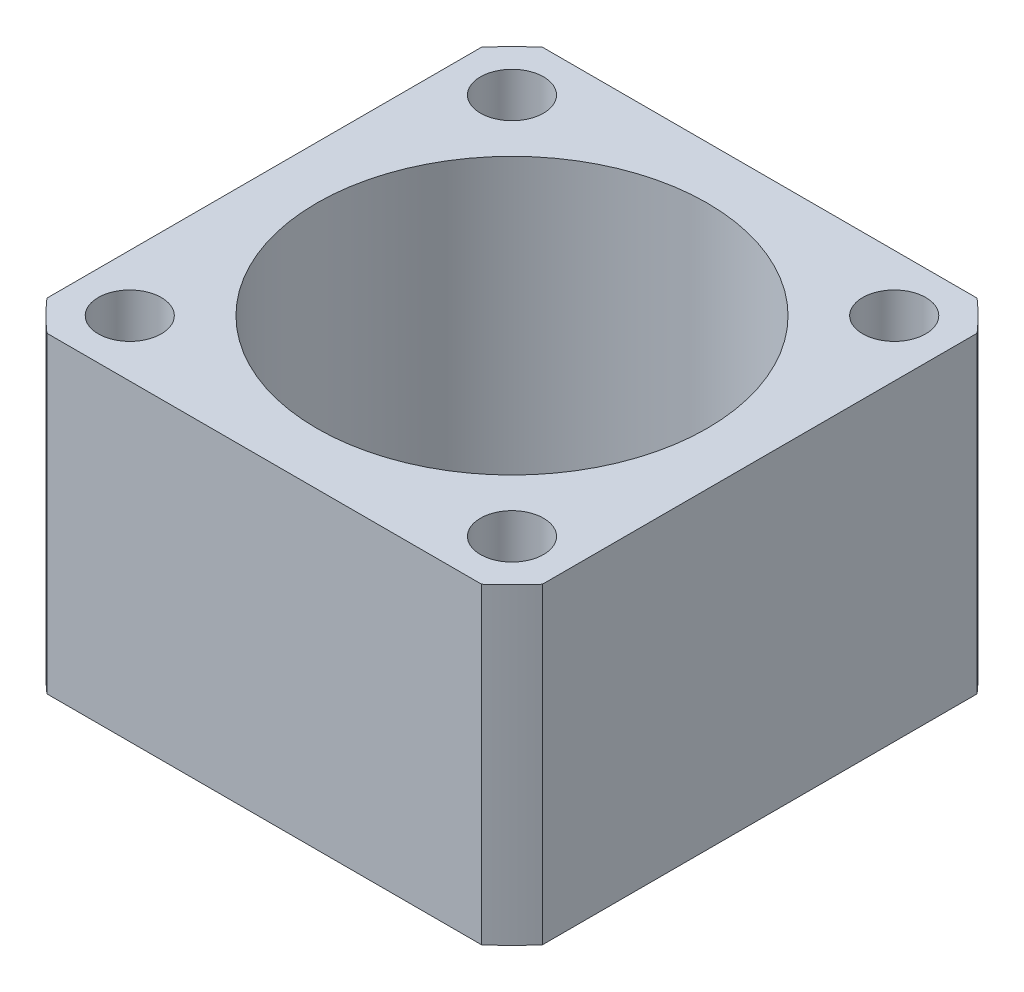
ISO-10303-21;
HEADER;
FILE_DESCRIPTION(('STEP AP214'),'2;1');
FILE_NAME('part.step','',(''),(''),'','','');
FILE_SCHEMA(('AUTOMOTIVE_DESIGN { 1 0 10303 214 1 1 1 1 }'));
ENDSEC;
DATA;
#1=APPLICATION_CONTEXT('core data for automotive mechanical design processes');
#2=APPLICATION_PROTOCOL_DEFINITION('international standard','automotive_design',2000,#1);
#3=PRODUCT_CONTEXT('',#1,'mechanical');
#4=PRODUCT('Part','Part','',(#3));
#5=PRODUCT_RELATED_PRODUCT_CATEGORY('part','',(#4));
#6=PRODUCT_DEFINITION_FORMATION('','',#4);
#7=PRODUCT_DEFINITION_CONTEXT('part definition',#1,'design');
#8=PRODUCT_DEFINITION('design','',#6,#7);
#9=PRODUCT_DEFINITION_SHAPE('','',#8);
#10=(LENGTH_UNIT() NAMED_UNIT(*) SI_UNIT(.MILLI.,.METRE.));
#11=(NAMED_UNIT(*) PLANE_ANGLE_UNIT() SI_UNIT($,.RADIAN.));
#12=(NAMED_UNIT(*) SI_UNIT($,.STERADIAN.) SOLID_ANGLE_UNIT());
#13=UNCERTAINTY_MEASURE_WITH_UNIT(LENGTH_MEASURE(1.E-05),#10,'distance_accuracy_value','');
#14=(GEOMETRIC_REPRESENTATION_CONTEXT(3) GLOBAL_UNCERTAINTY_ASSIGNED_CONTEXT((#13)) GLOBAL_UNIT_ASSIGNED_CONTEXT((#10,
#11,#12)) REPRESENTATION_CONTEXT('',''));
#15=CARTESIAN_POINT('',(0.,0.,0.));
#16=DIRECTION('',(0.,0.,1.));
#17=DIRECTION('',(1.,0.,0.));
#18=AXIS2_PLACEMENT_3D('',#15,#16,#17);
#19=CARTESIAN_POINT('',(0.,10.4,0.));
#20=DIRECTION('',(0.,1.,0.));
#21=DIRECTION('',(1.,0.,0.));
#22=AXIS2_PLACEMENT_3D('',#19,#20,#21);
#23=PLANE('',#22);
#24=CARTESIAN_POINT('',(0.,10.4,0.));
#25=DIRECTION('',(0.,-1.,0.));
#26=DIRECTION('',(1.,0.,0.));
#27=AXIS2_PLACEMENT_3D('',#24,#25,#26);
#28=CIRCLE('',#27,6.5);
#29=CARTESIAN_POINT('',(-6.5,10.4,0.));
#30=VERTEX_POINT('',#29);
#31=EDGE_CURVE('E241',#30,#30,#28,.T.);
#32=ORIENTED_EDGE('',*,*,#31,.T.);
#33=EDGE_LOOP('',(#32));
#34=FACE_BOUND('',#33,.T.);
#35=CARTESIAN_POINT('',(-6.36396103067893,10.4,-6.36396103067893));
#36=DIRECTION('',(0.,-1.,0.));
#37=DIRECTION('',(1.,0.,0.));
#38=AXIS2_PLACEMENT_3D('',#35,#36,#37);
#39=CIRCLE('',#38,1.05);
#40=CARTESIAN_POINT('',(-7.41396103067893,10.4,-6.36396103067893));
#41=VERTEX_POINT('',#40);
#42=EDGE_CURVE('E209',#41,#41,#39,.T.);
#43=ORIENTED_EDGE('',*,*,#42,.T.);
#44=EDGE_LOOP('',(#43));
#45=FACE_BOUND('',#44,.T.);
#46=CARTESIAN_POINT('',(6.36396103067893,10.4,-6.36396103067893));
#47=DIRECTION('',(0.,-1.,0.));
#48=DIRECTION('',(1.,0.,0.));
#49=AXIS2_PLACEMENT_3D('',#46,#47,#48);
#50=CIRCLE('',#49,1.05);
#51=CARTESIAN_POINT('',(5.31396103067893,10.4,-6.36396103067893));
#52=VERTEX_POINT('',#51);
#53=EDGE_CURVE('E234',#52,#52,#50,.T.);
#54=ORIENTED_EDGE('',*,*,#53,.T.);
#55=EDGE_LOOP('',(#54));
#56=FACE_BOUND('',#55,.T.);
#57=CARTESIAN_POINT('',(-6.36396103067893,10.4,6.36396103067893));
#58=DIRECTION('',(0.,-1.,0.));
#59=DIRECTION('',(1.,0.,0.));
#60=AXIS2_PLACEMENT_3D('',#57,#58,#59);
#61=CIRCLE('',#60,1.05);
#62=CARTESIAN_POINT('',(-7.41396103067893,10.4,6.36396103067893));
#63=VERTEX_POINT('',#62);
#64=EDGE_CURVE('E249',#63,#63,#61,.T.);
#65=ORIENTED_EDGE('',*,*,#64,.T.);
#66=EDGE_LOOP('',(#65));
#67=FACE_BOUND('',#66,.T.);
#68=CARTESIAN_POINT('',(6.36396103067893,10.4,6.36396103067893));
#69=DIRECTION('',(0.,-1.,0.));
#70=DIRECTION('',(1.,0.,0.));
#71=AXIS2_PLACEMENT_3D('',#68,#69,#70);
#72=CIRCLE('',#71,1.05);
#73=CARTESIAN_POINT('',(5.31396103067893,10.4,6.36396103067893));
#74=VERTEX_POINT('',#73);
#75=EDGE_CURVE('E27',#74,#74,#72,.T.);
#76=ORIENTED_EDGE('',*,*,#75,.T.);
#77=EDGE_LOOP('',(#76));
#78=FACE_BOUND('',#77,.T.);
#79=DIRECTION('',(0.,0.,-1.));
#80=VECTOR('',#79,1.);
#81=CARTESIAN_POINT('',(8.25,10.4,-3.61898207373289));
#82=LINE('',#81,#80);
#83=CARTESIAN_POINT('',(8.25,10.4,7.23796414746578));
#84=VERTEX_POINT('',#83);
#85=CARTESIAN_POINT('',(8.25,10.4,-7.23796414746578));
#86=VERTEX_POINT('',#85);
#87=EDGE_CURVE('E182',#84,#86,#82,.T.);
#88=ORIENTED_EDGE('',*,*,#87,.T.);
#89=CARTESIAN_POINT('',(0.,10.4,0.));
#90=DIRECTION('',(0.,1.,0.));
#91=DIRECTION('',(1.,0.,0.));
#92=AXIS2_PLACEMENT_3D('',#89,#90,#91);
#93=CIRCLE('',#92,10.975);
#94=CARTESIAN_POINT('',(7.23796414746578,10.4,-8.25));
#95=VERTEX_POINT('',#94);
#96=EDGE_CURVE('E166',#86,#95,#93,.T.);
#97=ORIENTED_EDGE('',*,*,#96,.T.);
#98=DIRECTION('',(-1.,0.,0.));
#99=VECTOR('',#98,1.);
#100=CARTESIAN_POINT('',(-3.61898207373289,10.4,-8.25));
#101=LINE('',#100,#99);
#102=CARTESIAN_POINT('',(-7.23796414746578,10.4,-8.25));
#103=VERTEX_POINT('',#102);
#104=EDGE_CURVE('E171',#95,#103,#101,.T.);
#105=ORIENTED_EDGE('',*,*,#104,.T.);
#106=CARTESIAN_POINT('',(0.,10.4,0.));
#107=DIRECTION('',(0.,1.,0.));
#108=DIRECTION('',(1.,0.,0.));
#109=AXIS2_PLACEMENT_3D('',#106,#107,#108);
#110=CIRCLE('',#109,10.975);
#111=CARTESIAN_POINT('',(-8.25,10.4,-7.23796414746578));
#112=VERTEX_POINT('',#111);
#113=EDGE_CURVE('E219',#103,#112,#110,.T.);
#114=ORIENTED_EDGE('',*,*,#113,.T.);
#115=DIRECTION('',(0.,0.,1.));
#116=VECTOR('',#115,1.);
#117=CARTESIAN_POINT('',(-8.25,10.4,3.61898207373289));
#118=LINE('',#117,#116);
#119=CARTESIAN_POINT('',(-8.25,10.4,7.23796414746578));
#120=VERTEX_POINT('',#119);
#121=EDGE_CURVE('E194',#112,#120,#118,.T.);
#122=ORIENTED_EDGE('',*,*,#121,.T.);
#123=CARTESIAN_POINT('',(0.,10.4,0.));
#124=DIRECTION('',(0.,1.,0.));
#125=DIRECTION('',(1.,0.,0.));
#126=AXIS2_PLACEMENT_3D('',#123,#124,#125);
#127=CIRCLE('',#126,10.975);
#128=CARTESIAN_POINT('',(-7.23796414746578,10.4,8.25));
#129=VERTEX_POINT('',#128);
#130=EDGE_CURVE('E216',#120,#129,#127,.T.);
#131=ORIENTED_EDGE('',*,*,#130,.T.);
#132=DIRECTION('',(1.,0.,0.));
#133=VECTOR('',#132,1.);
#134=CARTESIAN_POINT('',(3.61898207373289,10.4,8.25));
#135=LINE('',#134,#133);
#136=CARTESIAN_POINT('',(7.23796414746578,10.4,8.25));
#137=VERTEX_POINT('',#136);
#138=EDGE_CURVE('E269',#129,#137,#135,.T.);
#139=ORIENTED_EDGE('',*,*,#138,.T.);
#140=CARTESIAN_POINT('',(0.,10.4,0.));
#141=DIRECTION('',(0.,1.,0.));
#142=DIRECTION('',(1.,0.,0.));
#143=AXIS2_PLACEMENT_3D('',#140,#141,#142);
#144=CIRCLE('',#143,10.975);
#145=EDGE_CURVE('E222',#137,#84,#144,.T.);
#146=ORIENTED_EDGE('',*,*,#145,.T.);
#147=EDGE_LOOP('',(#88,#97,#105,#114,#122,#131,#139,#146));
#148=FACE_BOUND('',#147,.T.);
#149=ADVANCED_FACE('F16',(#34,#45,#56,#67,#78,#148),#23,.T.);
#150=CARTESIAN_POINT('',(6.36396103067893,0.,6.36396103067893));
#151=DIRECTION('',(0.,1.,0.));
#152=DIRECTION('',(1.,0.,0.));
#153=AXIS2_PLACEMENT_3D('',#150,#151,#152);
#154=CYLINDRICAL_SURFACE('',#153,1.05);
#155=ORIENTED_EDGE('',*,*,#75,.F.);
#156=DIRECTION('',(0.,-1.,0.));
#157=VECTOR('',#156,1.);
#158=CARTESIAN_POINT('',(5.31396103067893,0.,6.36396103067893));
#159=LINE('',#158,#157);
#160=CARTESIAN_POINT('',(5.31396103067893,0.,6.36396103067893));
#161=VERTEX_POINT('',#160);
#162=EDGE_CURVE('E11',#74,#161,#159,.T.);
#163=ORIENTED_EDGE('',*,*,#162,.T.);
#164=CARTESIAN_POINT('',(6.36396103067893,0.,6.36396103067893));
#165=DIRECTION('',(0.,-1.,0.));
#166=DIRECTION('',(1.,0.,0.));
#167=AXIS2_PLACEMENT_3D('',#164,#165,#166);
#168=CIRCLE('',#167,1.05);
#169=EDGE_CURVE('E186',#161,#161,#168,.T.);
#170=ORIENTED_EDGE('',*,*,#169,.T.);
#171=ORIENTED_EDGE('',*,*,#162,.F.);
#172=EDGE_LOOP('',(#155,#163,#170,#171));
#173=FACE_BOUND('',#172,.T.);
#174=ADVANCED_FACE('F317',(#173),#154,.F.);
#175=CARTESIAN_POINT('',(-6.36396103067893,0.,6.36396103067893));
#176=DIRECTION('',(0.,1.,0.));
#177=DIRECTION('',(1.,0.,0.));
#178=AXIS2_PLACEMENT_3D('',#175,#176,#177);
#179=CYLINDRICAL_SURFACE('',#178,1.05);
#180=ORIENTED_EDGE('',*,*,#64,.F.);
#181=DIRECTION('',(0.,-1.,0.));
#182=VECTOR('',#181,1.);
#183=CARTESIAN_POINT('',(-7.41396103067893,0.,6.36396103067893));
#184=LINE('',#183,#182);
#185=CARTESIAN_POINT('',(-7.41396103067893,0.,6.36396103067893));
#186=VERTEX_POINT('',#185);
#187=EDGE_CURVE('E253',#63,#186,#184,.T.);
#188=ORIENTED_EDGE('',*,*,#187,.T.);
#189=CARTESIAN_POINT('',(-6.36396103067893,0.,6.36396103067893));
#190=DIRECTION('',(0.,-1.,0.));
#191=DIRECTION('',(1.,0.,0.));
#192=AXIS2_PLACEMENT_3D('',#189,#190,#191);
#193=CIRCLE('',#192,1.05);
#194=EDGE_CURVE('E197',#186,#186,#193,.T.);
#195=ORIENTED_EDGE('',*,*,#194,.T.);
#196=ORIENTED_EDGE('',*,*,#187,.F.);
#197=EDGE_LOOP('',(#180,#188,#195,#196));
#198=FACE_BOUND('',#197,.T.);
#199=ADVANCED_FACE('F323',(#198),#179,.F.);
#200=CARTESIAN_POINT('',(6.36396103067893,0.,-6.36396103067893));
#201=DIRECTION('',(0.,1.,0.));
#202=DIRECTION('',(1.,0.,0.));
#203=AXIS2_PLACEMENT_3D('',#200,#201,#202);
#204=CYLINDRICAL_SURFACE('',#203,1.05);
#205=ORIENTED_EDGE('',*,*,#53,.F.);
#206=DIRECTION('',(0.,-1.,0.));
#207=VECTOR('',#206,1.);
#208=CARTESIAN_POINT('',(5.31396103067893,0.,-6.36396103067893));
#209=LINE('',#208,#207);
#210=CARTESIAN_POINT('',(5.31396103067893,0.,-6.36396103067893));
#211=VERTEX_POINT('',#210);
#212=EDGE_CURVE('E238',#52,#211,#209,.T.);
#213=ORIENTED_EDGE('',*,*,#212,.T.);
#214=CARTESIAN_POINT('',(6.36396103067893,0.,-6.36396103067893));
#215=DIRECTION('',(0.,-1.,0.));
#216=DIRECTION('',(1.,0.,0.));
#217=AXIS2_PLACEMENT_3D('',#214,#215,#216);
#218=CIRCLE('',#217,1.05);
#219=EDGE_CURVE('E190',#211,#211,#218,.T.);
#220=ORIENTED_EDGE('',*,*,#219,.T.);
#221=ORIENTED_EDGE('',*,*,#212,.F.);
#222=EDGE_LOOP('',(#205,#213,#220,#221));
#223=FACE_BOUND('',#222,.T.);
#224=ADVANCED_FACE('F329',(#223),#204,.F.);
#225=CARTESIAN_POINT('',(-6.36396103067893,0.,-6.36396103067893));
#226=DIRECTION('',(0.,1.,0.));
#227=DIRECTION('',(1.,0.,0.));
#228=AXIS2_PLACEMENT_3D('',#225,#226,#227);
#229=CYLINDRICAL_SURFACE('',#228,1.05);
#230=ORIENTED_EDGE('',*,*,#42,.F.);
#231=DIRECTION('',(0.,-1.,0.));
#232=VECTOR('',#231,1.);
#233=CARTESIAN_POINT('',(-7.41396103067893,0.,-6.36396103067893));
#234=LINE('',#233,#232);
#235=CARTESIAN_POINT('',(-7.41396103067893,0.,-6.36396103067893));
#236=VERTEX_POINT('',#235);
#237=EDGE_CURVE('E140',#41,#236,#234,.T.);
#238=ORIENTED_EDGE('',*,*,#237,.T.);
#239=CARTESIAN_POINT('',(-6.36396103067893,0.,-6.36396103067893));
#240=DIRECTION('',(0.,-1.,0.));
#241=DIRECTION('',(1.,0.,0.));
#242=AXIS2_PLACEMENT_3D('',#239,#240,#241);
#243=CIRCLE('',#242,1.05);
#244=EDGE_CURVE('E187',#236,#236,#243,.T.);
#245=ORIENTED_EDGE('',*,*,#244,.T.);
#246=ORIENTED_EDGE('',*,*,#237,.F.);
#247=EDGE_LOOP('',(#230,#238,#245,#246));
#248=FACE_BOUND('',#247,.T.);
#249=ADVANCED_FACE('F334',(#248),#229,.F.);
#250=CARTESIAN_POINT('',(0.,0.,0.));
#251=DIRECTION('',(0.,1.,0.));
#252=DIRECTION('',(1.,0.,0.));
#253=AXIS2_PLACEMENT_3D('',#250,#251,#252);
#254=CYLINDRICAL_SURFACE('',#253,6.5);
#255=ORIENTED_EDGE('',*,*,#31,.F.);
#256=DIRECTION('',(0.,-1.,0.));
#257=VECTOR('',#256,1.);
#258=CARTESIAN_POINT('',(-6.5,0.,0.));
#259=LINE('',#258,#257);
#260=CARTESIAN_POINT('',(-6.5,0.,0.));
#261=VERTEX_POINT('',#260);
#262=EDGE_CURVE('E129',#30,#261,#259,.T.);
#263=ORIENTED_EDGE('',*,*,#262,.T.);
#264=CARTESIAN_POINT('',(0.,0.,0.));
#265=DIRECTION('',(0.,-1.,0.));
#266=DIRECTION('',(1.,0.,0.));
#267=AXIS2_PLACEMENT_3D('',#264,#265,#266);
#268=CIRCLE('',#267,6.5);
#269=EDGE_CURVE('E160',#261,#261,#268,.T.);
#270=ORIENTED_EDGE('',*,*,#269,.T.);
#271=ORIENTED_EDGE('',*,*,#262,.F.);
#272=EDGE_LOOP('',(#255,#263,#270,#271));
#273=FACE_BOUND('',#272,.T.);
#274=ADVANCED_FACE('F333',(#273),#254,.F.);
#275=CARTESIAN_POINT('',(0.,0.,0.));
#276=DIRECTION('',(0.,1.,0.));
#277=DIRECTION('',(1.,0.,0.));
#278=AXIS2_PLACEMENT_3D('',#275,#276,#277);
#279=CYLINDRICAL_SURFACE('',#278,10.975);
#280=DIRECTION('',(0.,-1.,0.));
#281=VECTOR('',#280,1.);
#282=CARTESIAN_POINT('',(8.25,0.,-7.23796414746578));
#283=LINE('',#282,#281);
#284=CARTESIAN_POINT('',(8.25,0.,-7.23796414746578));
#285=VERTEX_POINT('',#284);
#286=EDGE_CURVE('E164',#86,#285,#283,.T.);
#287=ORIENTED_EDGE('',*,*,#286,.T.);
#288=CARTESIAN_POINT('',(0.,0.,0.));
#289=DIRECTION('',(0.,1.,0.));
#290=DIRECTION('',(1.,0.,0.));
#291=AXIS2_PLACEMENT_3D('',#288,#289,#290);
#292=CIRCLE('',#291,10.975);
#293=CARTESIAN_POINT('',(7.23796414746578,0.,-8.25));
#294=VERTEX_POINT('',#293);
#295=EDGE_CURVE('E148',#285,#294,#292,.T.);
#296=ORIENTED_EDGE('',*,*,#295,.T.);
#297=DIRECTION('',(0.,1.,0.));
#298=VECTOR('',#297,1.);
#299=CARTESIAN_POINT('',(7.23796414746578,0.,-8.25));
#300=LINE('',#299,#298);
#301=EDGE_CURVE('E206',#294,#95,#300,.T.);
#302=ORIENTED_EDGE('',*,*,#301,.T.);
#303=ORIENTED_EDGE('',*,*,#96,.F.);
#304=EDGE_LOOP('',(#287,#296,#302,#303));
#305=FACE_BOUND('',#304,.T.);
#306=ADVANCED_FACE('F165',(#305),#279,.T.);
#307=CARTESIAN_POINT('',(0.,0.,0.));
#308=DIRECTION('',(0.,1.,0.));
#309=DIRECTION('',(1.,0.,0.));
#310=AXIS2_PLACEMENT_3D('',#307,#308,#309);
#311=CYLINDRICAL_SURFACE('',#310,10.975);
#312=DIRECTION('',(0.,1.,0.));
#313=VECTOR('',#312,1.);
#314=CARTESIAN_POINT('',(8.25,0.,7.23796414746578));
#315=LINE('',#314,#313);
#316=CARTESIAN_POINT('',(8.25,0.,7.23796414746578));
#317=VERTEX_POINT('',#316);
#318=EDGE_CURVE('E175',#317,#84,#315,.T.);
#319=ORIENTED_EDGE('',*,*,#318,.T.);
#320=ORIENTED_EDGE('',*,*,#145,.F.);
#321=DIRECTION('',(0.,-1.,0.));
#322=VECTOR('',#321,1.);
#323=CARTESIAN_POINT('',(7.23796414746578,0.,8.25));
#324=LINE('',#323,#322);
#325=CARTESIAN_POINT('',(7.23796414746578,0.,8.25));
#326=VERTEX_POINT('',#325);
#327=EDGE_CURVE('E230',#137,#326,#324,.T.);
#328=ORIENTED_EDGE('',*,*,#327,.T.);
#329=CARTESIAN_POINT('',(0.,0.,0.));
#330=DIRECTION('',(0.,1.,0.));
#331=DIRECTION('',(1.,0.,0.));
#332=AXIS2_PLACEMENT_3D('',#329,#330,#331);
#333=CIRCLE('',#332,10.975);
#334=EDGE_CURVE('E259',#326,#317,#333,.T.);
#335=ORIENTED_EDGE('',*,*,#334,.T.);
#336=EDGE_LOOP('',(#319,#320,#328,#335));
#337=FACE_BOUND('',#336,.T.);
#338=ADVANCED_FACE('F18',(#337),#311,.T.);
#339=CARTESIAN_POINT('',(0.,0.,0.));
#340=DIRECTION('',(0.,1.,0.));
#341=DIRECTION('',(1.,0.,0.));
#342=AXIS2_PLACEMENT_3D('',#339,#340,#341);
#343=CYLINDRICAL_SURFACE('',#342,10.975);
#344=DIRECTION('',(0.,-1.,0.));
#345=VECTOR('',#344,1.);
#346=CARTESIAN_POINT('',(-7.23796414746578,0.,-8.25));
#347=LINE('',#346,#345);
#348=CARTESIAN_POINT('',(-7.23796414746578,0.,-8.25));
#349=VERTEX_POINT('',#348);
#350=EDGE_CURVE('E266',#103,#349,#347,.T.);
#351=ORIENTED_EDGE('',*,*,#350,.T.);
#352=CARTESIAN_POINT('',(0.,0.,0.));
#353=DIRECTION('',(0.,1.,0.));
#354=DIRECTION('',(1.,0.,0.));
#355=AXIS2_PLACEMENT_3D('',#352,#353,#354);
#356=CIRCLE('',#355,10.975);
#357=CARTESIAN_POINT('',(-8.25,0.,-7.23796414746578));
#358=VERTEX_POINT('',#357);
#359=EDGE_CURVE('E161',#349,#358,#356,.T.);
#360=ORIENTED_EDGE('',*,*,#359,.T.);
#361=DIRECTION('',(0.,1.,0.));
#362=VECTOR('',#361,1.);
#363=CARTESIAN_POINT('',(-8.25,0.,-7.23796414746578));
#364=LINE('',#363,#362);
#365=EDGE_CURVE('E214',#358,#112,#364,.T.);
#366=ORIENTED_EDGE('',*,*,#365,.T.);
#367=ORIENTED_EDGE('',*,*,#113,.F.);
#368=EDGE_LOOP('',(#351,#360,#366,#367));
#369=FACE_BOUND('',#368,.T.);
#370=ADVANCED_FACE('F288',(#369),#343,.T.);
#371=CARTESIAN_POINT('',(0.,0.,0.));
#372=DIRECTION('',(0.,1.,0.));
#373=DIRECTION('',(1.,0.,0.));
#374=AXIS2_PLACEMENT_3D('',#371,#372,#373);
#375=CYLINDRICAL_SURFACE('',#374,10.975);
#376=DIRECTION('',(0.,1.,0.));
#377=VECTOR('',#376,1.);
#378=CARTESIAN_POINT('',(-7.23796414746578,0.,8.25));
#379=LINE('',#378,#377);
#380=CARTESIAN_POINT('',(-7.23796414746578,0.,8.25));
#381=VERTEX_POINT('',#380);
#382=EDGE_CURVE('E20',#381,#129,#379,.T.);
#383=ORIENTED_EDGE('',*,*,#382,.T.);
#384=ORIENTED_EDGE('',*,*,#130,.F.);
#385=DIRECTION('',(0.,-1.,0.));
#386=VECTOR('',#385,1.);
#387=CARTESIAN_POINT('',(-8.25,0.,7.23796414746578));
#388=LINE('',#387,#386);
#389=CARTESIAN_POINT('',(-8.25,0.,7.23796414746578));
#390=VERTEX_POINT('',#389);
#391=EDGE_CURVE('E191',#120,#390,#388,.T.);
#392=ORIENTED_EDGE('',*,*,#391,.T.);
#393=CARTESIAN_POINT('',(0.,0.,0.));
#394=DIRECTION('',(0.,1.,0.));
#395=DIRECTION('',(1.,0.,0.));
#396=AXIS2_PLACEMENT_3D('',#393,#394,#395);
#397=CIRCLE('',#396,10.975);
#398=EDGE_CURVE('E256',#390,#381,#397,.T.);
#399=ORIENTED_EDGE('',*,*,#398,.T.);
#400=EDGE_LOOP('',(#383,#384,#392,#399));
#401=FACE_BOUND('',#400,.T.);
#402=ADVANCED_FACE('F298',(#401),#375,.T.);
#403=CARTESIAN_POINT('',(0.,0.,0.));
#404=DIRECTION('',(0.,1.,0.));
#405=DIRECTION('',(1.,0.,0.));
#406=AXIS2_PLACEMENT_3D('',#403,#404,#405);
#407=PLANE('',#406);
#408=ORIENTED_EDGE('',*,*,#169,.F.);
#409=EDGE_LOOP('',(#408));
#410=FACE_BOUND('',#409,.T.);
#411=ORIENTED_EDGE('',*,*,#194,.F.);
#412=EDGE_LOOP('',(#411));
#413=FACE_BOUND('',#412,.T.);
#414=ORIENTED_EDGE('',*,*,#219,.F.);
#415=EDGE_LOOP('',(#414));
#416=FACE_BOUND('',#415,.T.);
#417=ORIENTED_EDGE('',*,*,#244,.F.);
#418=EDGE_LOOP('',(#417));
#419=FACE_BOUND('',#418,.T.);
#420=ORIENTED_EDGE('',*,*,#269,.F.);
#421=EDGE_LOOP('',(#420));
#422=FACE_BOUND('',#421,.T.);
#423=DIRECTION('',(0.,0.,1.));
#424=VECTOR('',#423,1.);
#425=CARTESIAN_POINT('',(8.25,0.,-3.61898207373289));
#426=LINE('',#425,#424);
#427=EDGE_CURVE('E152',#285,#317,#426,.T.);
#428=ORIENTED_EDGE('',*,*,#427,.T.);
#429=ORIENTED_EDGE('',*,*,#334,.F.);
#430=DIRECTION('',(-1.,0.,0.));
#431=VECTOR('',#430,1.);
#432=CARTESIAN_POINT('',(3.61898207373289,0.,8.25));
#433=LINE('',#432,#431);
#434=EDGE_CURVE('E226',#326,#381,#433,.T.);
#435=ORIENTED_EDGE('',*,*,#434,.T.);
#436=ORIENTED_EDGE('',*,*,#398,.F.);
#437=DIRECTION('',(0.,0.,-1.));
#438=VECTOR('',#437,1.);
#439=CARTESIAN_POINT('',(-8.25,0.,3.61898207373289));
#440=LINE('',#439,#438);
#441=EDGE_CURVE('E195',#390,#358,#440,.T.);
#442=ORIENTED_EDGE('',*,*,#441,.T.);
#443=ORIENTED_EDGE('',*,*,#359,.F.);
#444=DIRECTION('',(1.,0.,0.));
#445=VECTOR('',#444,1.);
#446=CARTESIAN_POINT('',(-3.61898207373289,0.,-8.25));
#447=LINE('',#446,#445);
#448=EDGE_CURVE('E155',#349,#294,#447,.T.);
#449=ORIENTED_EDGE('',*,*,#448,.T.);
#450=ORIENTED_EDGE('',*,*,#295,.F.);
#451=EDGE_LOOP('',(#428,#429,#435,#436,#442,#443,#449,#450));
#452=FACE_BOUND('',#451,.T.);
#453=ADVANCED_FACE('F150',(#410,#413,#416,#419,#422,#452),#407,.F.);
#454=CARTESIAN_POINT('',(-8.25,-2.5,7.23796414746577));
#455=DIRECTION('',(1.,0.,0.));
#456=DIRECTION('',(0.,1.,0.));
#457=AXIS2_PLACEMENT_3D('',#454,#455,#456);
#458=PLANE('',#457);
#459=ORIENTED_EDGE('',*,*,#441,.F.);
#460=ORIENTED_EDGE('',*,*,#391,.F.);
#461=ORIENTED_EDGE('',*,*,#121,.F.);
#462=ORIENTED_EDGE('',*,*,#365,.F.);
#463=EDGE_LOOP('',(#459,#460,#461,#462));
#464=FACE_BOUND('',#463,.T.);
#465=ADVANCED_FACE('F292',(#464),#458,.F.);
#466=CARTESIAN_POINT('',(7.23796414746577,-2.5,8.25));
#467=DIRECTION('',(0.,0.,-1.));
#468=DIRECTION('',(0.,-1.,0.));
#469=AXIS2_PLACEMENT_3D('',#466,#467,#468);
#470=PLANE('',#469);
#471=ORIENTED_EDGE('',*,*,#138,.F.);
#472=ORIENTED_EDGE('',*,*,#382,.F.);
#473=ORIENTED_EDGE('',*,*,#434,.F.);
#474=ORIENTED_EDGE('',*,*,#327,.F.);
#475=EDGE_LOOP('',(#471,#472,#473,#474));
#476=FACE_BOUND('',#475,.T.);
#477=ADVANCED_FACE('F305',(#476),#470,.F.);
#478=CARTESIAN_POINT('',(-7.23796414746578,-2.5,-8.25));
#479=DIRECTION('',(0.,0.,1.));
#480=DIRECTION('',(1.,0.,0.));
#481=AXIS2_PLACEMENT_3D('',#478,#479,#480);
#482=PLANE('',#481);
#483=ORIENTED_EDGE('',*,*,#104,.F.);
#484=ORIENTED_EDGE('',*,*,#301,.F.);
#485=ORIENTED_EDGE('',*,*,#448,.F.);
#486=ORIENTED_EDGE('',*,*,#350,.F.);
#487=EDGE_LOOP('',(#483,#484,#485,#486));
#488=FACE_BOUND('',#487,.T.);
#489=ADVANCED_FACE('F303',(#488),#482,.F.);
#490=CARTESIAN_POINT('',(8.25,-2.5,-7.23796414746577));
#491=DIRECTION('',(-1.,0.,0.));
#492=DIRECTION('',(0.,0.,1.));
#493=AXIS2_PLACEMENT_3D('',#490,#491,#492);
#494=PLANE('',#493);
#495=ORIENTED_EDGE('',*,*,#87,.F.);
#496=ORIENTED_EDGE('',*,*,#318,.F.);
#497=ORIENTED_EDGE('',*,*,#427,.F.);
#498=ORIENTED_EDGE('',*,*,#286,.F.);
#499=EDGE_LOOP('',(#495,#496,#497,#498));
#500=FACE_BOUND('',#499,.T.);
#501=ADVANCED_FACE('F173',(#500),#494,.F.);
#502=CLOSED_SHELL('',(#149,#174,#199,#224,#249,#274,#306,#338,#370,#402,#453,#465,#477,#489,#501));
#503=MANIFOLD_SOLID_BREP('B1',#502);
#504=ADVANCED_BREP_SHAPE_REPRESENTATION('',(#18,#503),#14);
#505=SHAPE_DEFINITION_REPRESENTATION(#9,#504);
ENDSEC;
END-ISO-10303-21;
